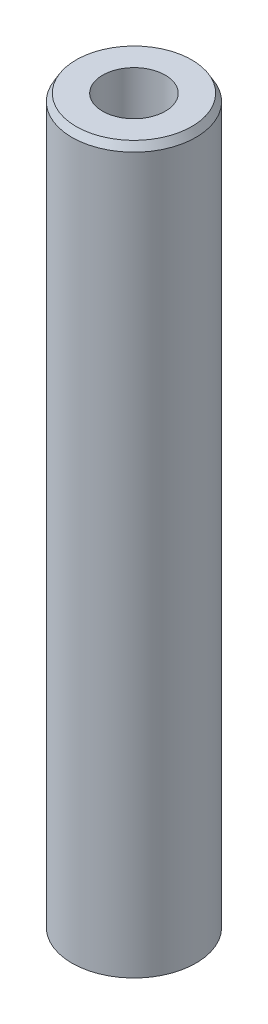
ISO-10303-21;
HEADER;
FILE_DESCRIPTION(('STEP AP214'),'2;1');
FILE_NAME('part.step','',(''),(''),'','','');
FILE_SCHEMA(('AUTOMOTIVE_DESIGN { 1 0 10303 214 1 1 1 1 }'));
ENDSEC;
DATA;
#1=APPLICATION_CONTEXT('core data for automotive mechanical design processes');
#2=APPLICATION_PROTOCOL_DEFINITION('international standard','automotive_design',2000,#1);
#3=PRODUCT_CONTEXT('',#1,'mechanical');
#4=PRODUCT('Part','Part','',(#3));
#5=PRODUCT_RELATED_PRODUCT_CATEGORY('part','',(#4));
#6=PRODUCT_DEFINITION_FORMATION('','',#4);
#7=PRODUCT_DEFINITION_CONTEXT('part definition',#1,'design');
#8=PRODUCT_DEFINITION('design','',#6,#7);
#9=PRODUCT_DEFINITION_SHAPE('','',#8);
#10=(LENGTH_UNIT() NAMED_UNIT(*) SI_UNIT(.MILLI.,.METRE.));
#11=(NAMED_UNIT(*) PLANE_ANGLE_UNIT() SI_UNIT($,.RADIAN.));
#12=(NAMED_UNIT(*) SI_UNIT($,.STERADIAN.) SOLID_ANGLE_UNIT());
#13=UNCERTAINTY_MEASURE_WITH_UNIT(LENGTH_MEASURE(1.E-05),#10,'distance_accuracy_value','');
#14=(GEOMETRIC_REPRESENTATION_CONTEXT(3) GLOBAL_UNCERTAINTY_ASSIGNED_CONTEXT((#13)) GLOBAL_UNIT_ASSIGNED_CONTEXT((#10,
#11,#12)) REPRESENTATION_CONTEXT('',''));
#15=CARTESIAN_POINT('',(0.,0.,0.));
#16=DIRECTION('',(0.,0.,1.));
#17=DIRECTION('',(1.,0.,0.));
#18=AXIS2_PLACEMENT_3D('',#15,#16,#17);
#19=CARTESIAN_POINT('',(0.,292.999830783142,0.));
#20=DIRECTION('',(0.,-1.,0.));
#21=DIRECTION('',(0.,0.,-1.));
#22=AXIS2_PLACEMENT_3D('',#19,#20,#21);
#23=CYLINDRICAL_SURFACE('',#22,25.);
#24=CARTESIAN_POINT('',(0.,290.060956048103,0.));
#25=DIRECTION('',(0.,1.,0.));
#26=DIRECTION('',(0.,0.,1.));
#27=AXIS2_PLACEMENT_3D('',#24,#25,#26);
#28=CIRCLE('',#27,25.);
#29=CARTESIAN_POINT('',(0.,290.060956048103,25.));
#30=VERTEX_POINT('',#29);
#31=EDGE_CURVE('E50',#30,#30,#28,.F.);
#32=ORIENTED_EDGE('',*,*,#31,.T.);
#33=EDGE_LOOP('',(#32));
#34=FACE_BOUND('',#33,.T.);
#35=CARTESIAN_POINT('',(0.,1.6967601193898,0.));
#36=DIRECTION('',(0.,1.,0.));
#37=DIRECTION('',(0.,0.,1.));
#38=AXIS2_PLACEMENT_3D('',#35,#36,#37);
#39=CIRCLE('',#38,25.);
#40=CARTESIAN_POINT('',(0.,1.6967601193898,25.));
#41=VERTEX_POINT('',#40);
#42=EDGE_CURVE('E51',#41,#41,#39,.T.);
#43=ORIENTED_EDGE('',*,*,#42,.T.);
#44=EDGE_LOOP('',(#43));
#45=FACE_BOUND('',#44,.T.);
#46=ADVANCED_FACE('F39',(#34,#45),#23,.T.);
#47=CARTESIAN_POINT('',(0.,292.999830783142,0.));
#48=DIRECTION('',(0.,1.,0.));
#49=DIRECTION('',(0.,0.,1.));
#50=AXIS2_PLACEMENT_3D('',#47,#48,#49);
#51=PLANE('',#50);
#52=CARTESIAN_POINT('',(0.,292.999830783142,0.));
#53=DIRECTION('',(0.,1.,0.));
#54=DIRECTION('',(0.,0.,1.));
#55=AXIS2_PLACEMENT_3D('',#52,#53,#54);
#56=CIRCLE('',#55,23.3032398806101);
#57=CARTESIAN_POINT('',(0.,292.999830783142,23.3032398806101));
#58=VERTEX_POINT('',#57);
#59=EDGE_CURVE('E54',#58,#58,#56,.T.);
#60=ORIENTED_EDGE('',*,*,#59,.T.);
#61=EDGE_LOOP('',(#60));
#62=FACE_BOUND('',#61,.T.);
#63=CARTESIAN_POINT('',(0.,292.999830783142,0.));
#64=DIRECTION('',(0.,1.,0.));
#65=DIRECTION('',(0.,0.,1.));
#66=AXIS2_PLACEMENT_3D('',#63,#64,#65);
#67=CIRCLE('',#66,12.6337667325079);
#68=CARTESIAN_POINT('',(0.,292.999830783142,12.6337667325079));
#69=VERTEX_POINT('',#68);
#70=EDGE_CURVE('E58',#69,#69,#67,.T.);
#71=ORIENTED_EDGE('',*,*,#70,.F.);
#72=EDGE_LOOP('',(#71));
#73=FACE_BOUND('',#72,.T.);
#74=ADVANCED_FACE('F69',(#62,#73),#51,.T.);
#75=CARTESIAN_POINT('',(0.,0.,0.));
#76=DIRECTION('',(0.,1.,0.));
#77=DIRECTION('',(0.,0.,1.));
#78=AXIS2_PLACEMENT_3D('',#75,#76,#77);
#79=PLANE('',#78);
#80=CARTESIAN_POINT('',(0.,0.,0.));
#81=DIRECTION('',(0.,1.,0.));
#82=DIRECTION('',(0.,0.,1.));
#83=AXIS2_PLACEMENT_3D('',#80,#81,#82);
#84=CIRCLE('',#83,22.0611252649602);
#85=CARTESIAN_POINT('',(0.,0.,22.0611252649602));
#86=VERTEX_POINT('',#85);
#87=EDGE_CURVE('E10',#86,#86,#84,.F.);
#88=ORIENTED_EDGE('',*,*,#87,.T.);
#89=EDGE_LOOP('',(#88));
#90=FACE_BOUND('',#89,.T.);
#91=CARTESIAN_POINT('',(0.,0.,0.));
#92=DIRECTION('',(0.,1.,0.));
#93=DIRECTION('',(0.,0.,1.));
#94=AXIS2_PLACEMENT_3D('',#91,#92,#93);
#95=CIRCLE('',#94,12.6337667325079);
#96=CARTESIAN_POINT('',(0.,0.,12.6337667325079));
#97=VERTEX_POINT('',#96);
#98=EDGE_CURVE('E63',#97,#97,#95,.T.);
#99=ORIENTED_EDGE('',*,*,#98,.T.);
#100=EDGE_LOOP('',(#99));
#101=FACE_BOUND('',#100,.T.);
#102=ADVANCED_FACE('F75',(#90,#101),#79,.F.);
#103=CARTESIAN_POINT('',(0.,292.999830783142,0.));
#104=DIRECTION('',(0.,-1.,0.));
#105=DIRECTION('',(0.,0.,-1.));
#106=AXIS2_PLACEMENT_3D('',#103,#104,#105);
#107=CYLINDRICAL_SURFACE('',#106,12.6337667325079);
#108=ORIENTED_EDGE('',*,*,#70,.T.);
#109=EDGE_LOOP('',(#108));
#110=FACE_BOUND('',#109,.T.);
#111=ORIENTED_EDGE('',*,*,#98,.F.);
#112=EDGE_LOOP('',(#111));
#113=FACE_BOUND('',#112,.T.);
#114=ADVANCED_FACE('F70',(#110,#113),#107,.F.);
#115=CARTESIAN_POINT('',(0.,292.999830783142,0.));
#116=DIRECTION('',(0.,-1.,0.));
#117=DIRECTION('',(0.,0.,-1.));
#118=AXIS2_PLACEMENT_3D('',#115,#116,#117);
#119=CONICAL_SURFACE('',#118,23.3032398806101,0.523598775598294);
#120=ORIENTED_EDGE('',*,*,#31,.F.);
#121=EDGE_LOOP('',(#120));
#122=FACE_BOUND('',#121,.T.);
#123=ORIENTED_EDGE('',*,*,#59,.F.);
#124=EDGE_LOOP('',(#123));
#125=FACE_BOUND('',#124,.T.);
#126=ADVANCED_FACE('F81',(#122,#125),#119,.T.);
#127=CARTESIAN_POINT('',(0.,1.6967601193898,0.));
#128=DIRECTION('',(0.,1.,0.));
#129=DIRECTION('',(0.,0.,1.));
#130=AXIS2_PLACEMENT_3D('',#127,#128,#129);
#131=CONICAL_SURFACE('',#130,25.,1.0471975511966);
#132=ORIENTED_EDGE('',*,*,#87,.F.);
#133=EDGE_LOOP('',(#132));
#134=FACE_BOUND('',#133,.T.);
#135=ORIENTED_EDGE('',*,*,#42,.F.);
#136=EDGE_LOOP('',(#135));
#137=FACE_BOUND('',#136,.T.);
#138=ADVANCED_FACE('F45',(#134,#137),#131,.T.);
#139=CLOSED_SHELL('',(#46,#74,#102,#114,#126,#138));
#140=MANIFOLD_SOLID_BREP('B2',#139);
#141=ADVANCED_BREP_SHAPE_REPRESENTATION('',(#18,#140),#14);
#142=SHAPE_DEFINITION_REPRESENTATION(#9,#141);
ENDSEC;
END-ISO-10303-21;
